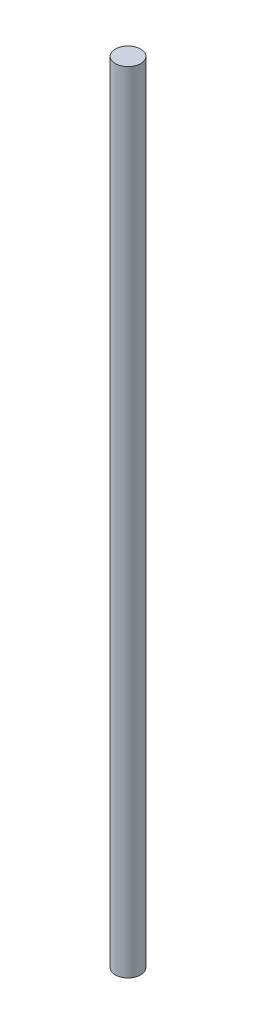
ISO-10303-21;
HEADER;
FILE_DESCRIPTION(('STEP AP214'),'2;1');
FILE_NAME('part.step','',(''),(''),'','','');
FILE_SCHEMA(('AUTOMOTIVE_DESIGN { 1 0 10303 214 1 1 1 1 }'));
ENDSEC;
DATA;
#1=APPLICATION_CONTEXT('core data for automotive mechanical design processes');
#2=APPLICATION_PROTOCOL_DEFINITION('international standard','automotive_design',2000,#1);
#3=PRODUCT_CONTEXT('',#1,'mechanical');
#4=PRODUCT('Part','Part','',(#3));
#5=PRODUCT_RELATED_PRODUCT_CATEGORY('part','',(#4));
#6=PRODUCT_DEFINITION_FORMATION('','',#4);
#7=PRODUCT_DEFINITION_CONTEXT('part definition',#1,'design');
#8=PRODUCT_DEFINITION('design','',#6,#7);
#9=PRODUCT_DEFINITION_SHAPE('','',#8);
#10=(LENGTH_UNIT() NAMED_UNIT(*) SI_UNIT(.MILLI.,.METRE.));
#11=(NAMED_UNIT(*) PLANE_ANGLE_UNIT() SI_UNIT($,.RADIAN.));
#12=(NAMED_UNIT(*) SI_UNIT($,.STERADIAN.) SOLID_ANGLE_UNIT());
#13=UNCERTAINTY_MEASURE_WITH_UNIT(LENGTH_MEASURE(1.E-05),#10,'distance_accuracy_value','');
#14=(GEOMETRIC_REPRESENTATION_CONTEXT(3) GLOBAL_UNCERTAINTY_ASSIGNED_CONTEXT((#13)) GLOBAL_UNIT_ASSIGNED_CONTEXT((#10,
#11,#12)) REPRESENTATION_CONTEXT('',''));
#15=CARTESIAN_POINT('',(0.,0.,0.));
#16=DIRECTION('',(0.,0.,1.));
#17=DIRECTION('',(1.,0.,0.));
#18=AXIS2_PLACEMENT_3D('',#15,#16,#17);
#19=CARTESIAN_POINT('',(0.,250.,0.));
#20=DIRECTION('',(0.,-1.,0.));
#21=DIRECTION('',(0.,0.,-1.));
#22=AXIS2_PLACEMENT_3D('',#19,#20,#21);
#23=CYLINDRICAL_SURFACE('',#22,4.);
#24=CARTESIAN_POINT('',(0.,250.,0.));
#25=DIRECTION('',(0.,1.,0.));
#26=DIRECTION('',(0.,0.,1.));
#27=AXIS2_PLACEMENT_3D('',#24,#25,#26);
#28=CIRCLE('',#27,4.);
#29=CARTESIAN_POINT('',(0.,250.,4.));
#30=VERTEX_POINT('',#29);
#31=EDGE_CURVE('E10',#30,#30,#28,.T.);
#32=ORIENTED_EDGE('',*,*,#31,.F.);
#33=EDGE_LOOP('',(#32));
#34=FACE_BOUND('',#33,.T.);
#35=CARTESIAN_POINT('',(0.,0.,0.));
#36=DIRECTION('',(0.,1.,0.));
#37=DIRECTION('',(0.,0.,1.));
#38=AXIS2_PLACEMENT_3D('',#35,#36,#37);
#39=CIRCLE('',#38,4.);
#40=CARTESIAN_POINT('',(0.,0.,4.));
#41=VERTEX_POINT('',#40);
#42=EDGE_CURVE('E38',#41,#41,#39,.T.);
#43=ORIENTED_EDGE('',*,*,#42,.T.);
#44=EDGE_LOOP('',(#43));
#45=FACE_BOUND('',#44,.T.);
#46=ADVANCED_FACE('F35',(#34,#45),#23,.T.);
#47=CARTESIAN_POINT('',(0.,250.,0.));
#48=DIRECTION('',(0.,1.,0.));
#49=DIRECTION('',(0.,0.,1.));
#50=AXIS2_PLACEMENT_3D('',#47,#48,#49);
#51=PLANE('',#50);
#52=ORIENTED_EDGE('',*,*,#31,.T.);
#53=EDGE_LOOP('',(#52));
#54=FACE_BOUND('',#53,.T.);
#55=ADVANCED_FACE('F50',(#54),#51,.T.);
#56=CARTESIAN_POINT('',(0.,0.,0.));
#57=DIRECTION('',(0.,1.,0.));
#58=DIRECTION('',(0.,0.,1.));
#59=AXIS2_PLACEMENT_3D('',#56,#57,#58);
#60=PLANE('',#59);
#61=ORIENTED_EDGE('',*,*,#42,.F.);
#62=EDGE_LOOP('',(#61));
#63=FACE_BOUND('',#62,.T.);
#64=ADVANCED_FACE('F48',(#63),#60,.F.);
#65=CLOSED_SHELL('',(#46,#55,#64));
#66=MANIFOLD_SOLID_BREP('B2',#65);
#67=ADVANCED_BREP_SHAPE_REPRESENTATION('',(#18,#66),#14);
#68=SHAPE_DEFINITION_REPRESENTATION(#9,#67);
ENDSEC;
END-ISO-10303-21;
